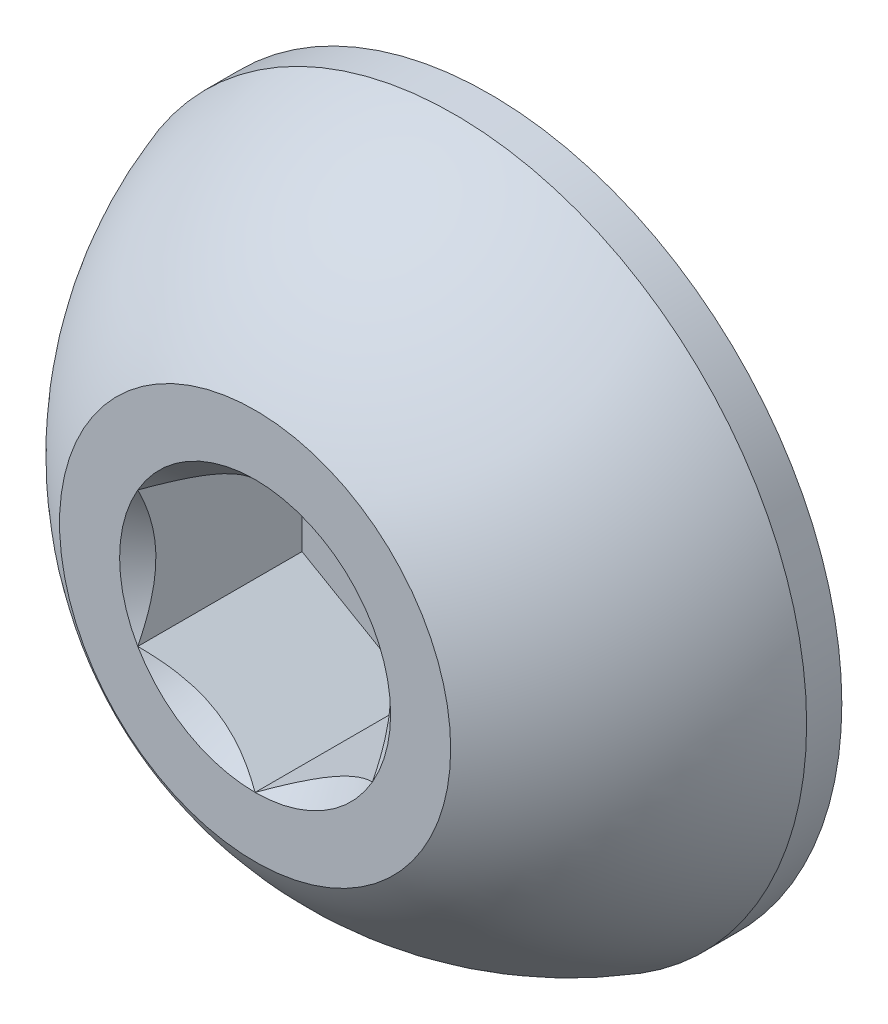
ISO-10303-21;
HEADER;
FILE_DESCRIPTION(('STEP AP214'),'2;1');
FILE_NAME('part.step','',(''),(''),'','','');
FILE_SCHEMA(('AUTOMOTIVE_DESIGN { 1 0 10303 214 1 1 1 1 }'));
ENDSEC;
DATA;
#1=APPLICATION_CONTEXT('core data for automotive mechanical design processes');
#2=APPLICATION_PROTOCOL_DEFINITION('international standard','automotive_design',2000,#1);
#3=PRODUCT_CONTEXT('',#1,'mechanical');
#4=PRODUCT('Part','Part','',(#3));
#5=PRODUCT_RELATED_PRODUCT_CATEGORY('part','',(#4));
#6=PRODUCT_DEFINITION_FORMATION('','',#4);
#7=PRODUCT_DEFINITION_CONTEXT('part definition',#1,'design');
#8=PRODUCT_DEFINITION('design','',#6,#7);
#9=PRODUCT_DEFINITION_SHAPE('','',#8);
#10=(LENGTH_UNIT() NAMED_UNIT(*) SI_UNIT(.MILLI.,.METRE.));
#11=(NAMED_UNIT(*) PLANE_ANGLE_UNIT() SI_UNIT($,.RADIAN.));
#12=(NAMED_UNIT(*) SI_UNIT($,.STERADIAN.) SOLID_ANGLE_UNIT());
#13=UNCERTAINTY_MEASURE_WITH_UNIT(LENGTH_MEASURE(1.E-05),#10,'distance_accuracy_value','');
#14=(GEOMETRIC_REPRESENTATION_CONTEXT(3) GLOBAL_UNCERTAINTY_ASSIGNED_CONTEXT((#13)) GLOBAL_UNIT_ASSIGNED_CONTEXT((#10,
#11,#12)) REPRESENTATION_CONTEXT('',''));
#15=CARTESIAN_POINT('',(0.,0.,0.));
#16=DIRECTION('',(0.,0.,1.));
#17=DIRECTION('',(1.,0.,0.));
#18=AXIS2_PLACEMENT_3D('',#15,#16,#17);
#19=CARTESIAN_POINT('',(0.,0.,-2.01004901960784));
#20=DIRECTION('',(0.,0.,1.));
#21=DIRECTION('',(0.,-1.,0.));
#22=AXIS2_PLACEMENT_3D('',#19,#20,#21);
#23=SPHERICAL_SURFACE('',#22,2.3670228265115);
#24=CARTESIAN_POINT('',(0.,0.,0.));
#25=DIRECTION('',(0.,0.,1.));
#26=DIRECTION('',(1.,0.,0.));
#27=AXIS2_PLACEMENT_3D('',#24,#25,#26);
#28=CIRCLE('',#27,1.25000000000002);
#29=CARTESIAN_POINT('',(1.25000000000002,0.,0.));
#30=VERTEX_POINT('',#29);
#31=EDGE_CURVE('E56',#30,#30,#28,.T.);
#32=ORIENTED_EDGE('',*,*,#31,.F.);
#33=EDGE_LOOP('',(#32));
#34=FACE_BOUND('',#33,.T.);
#35=CARTESIAN_POINT('',(0.,0.,-1.275));
#36=DIRECTION('',(0.,0.,1.));
#37=DIRECTION('',(1.,0.,0.));
#38=AXIS2_PLACEMENT_3D('',#35,#36,#37);
#39=CIRCLE('',#38,2.25);
#40=CARTESIAN_POINT('',(2.25,0.,-1.275));
#41=VERTEX_POINT('',#40);
#42=EDGE_CURVE('E170',#41,#41,#39,.T.);
#43=ORIENTED_EDGE('',*,*,#42,.T.);
#44=EDGE_LOOP('',(#43));
#45=FACE_BOUND('',#44,.T.);
#46=ADVANCED_FACE('F43',(#34,#45),#23,.T.);
#47=CARTESIAN_POINT('',(0.,-1.25000000000002,0.));
#48=DIRECTION('',(0.,0.,-1.));
#49=DIRECTION('',(-1.,0.,0.));
#50=AXIS2_PLACEMENT_3D('',#47,#48,#49);
#51=PLANE('',#50);
#52=CARTESIAN_POINT('',(0.,0.,0.));
#53=DIRECTION('',(0.,0.,1.));
#54=DIRECTION('',(1.,0.,0.));
#55=AXIS2_PLACEMENT_3D('',#52,#53,#54);
#56=CIRCLE('',#55,0.866025403784436);
#57=CARTESIAN_POINT('',(-0.749999999999998,0.433012701892219,0.));
#58=VERTEX_POINT('',#57);
#59=CARTESIAN_POINT('',(-0.749999999999997,-0.43301270189222,0.));
#60=VERTEX_POINT('',#59);
#61=EDGE_CURVE('E69',#58,#60,#56,.T.);
#62=ORIENTED_EDGE('',*,*,#61,.F.);
#63=CARTESIAN_POINT('',(0.,0.866025403784436,0.));
#64=VERTEX_POINT('',#63);
#65=EDGE_CURVE('E141',#64,#58,#56,.T.);
#66=ORIENTED_EDGE('',*,*,#65,.F.);
#67=CARTESIAN_POINT('',(0.749999999999999,0.433012701892216,0.));
#68=VERTEX_POINT('',#67);
#69=EDGE_CURVE('E138',#68,#64,#56,.T.);
#70=ORIENTED_EDGE('',*,*,#69,.F.);
#71=CARTESIAN_POINT('',(0.749999999999999,-0.433012701892216,0.));
#72=VERTEX_POINT('',#71);
#73=EDGE_CURVE('E109',#72,#68,#56,.T.);
#74=ORIENTED_EDGE('',*,*,#73,.F.);
#75=CARTESIAN_POINT('',(0.,-0.866025403784436,0.));
#76=VERTEX_POINT('',#75);
#77=EDGE_CURVE('E101',#76,#72,#56,.T.);
#78=ORIENTED_EDGE('',*,*,#77,.F.);
#79=EDGE_CURVE('E62',#60,#76,#56,.T.);
#80=ORIENTED_EDGE('',*,*,#79,.F.);
#81=EDGE_LOOP('',(#62,#66,#70,#74,#78,#80));
#82=FACE_BOUND('',#81,.T.);
#83=ORIENTED_EDGE('',*,*,#31,.T.);
#84=EDGE_LOOP('',(#83));
#85=FACE_BOUND('',#84,.T.);
#86=ADVANCED_FACE('F135',(#82,#85),#51,.F.);
#87=CARTESIAN_POINT('',(0.,-2.25,-1.5));
#88=DIRECTION('',(0.,0.,1.));
#89=DIRECTION('',(1.,0.,0.));
#90=AXIS2_PLACEMENT_3D('',#87,#88,#89);
#91=PLANE('',#90);
#92=CARTESIAN_POINT('',(0.,0.,-1.5));
#93=DIRECTION('',(0.,0.,1.));
#94=DIRECTION('',(1.,0.,0.));
#95=AXIS2_PLACEMENT_3D('',#92,#93,#94);
#96=CIRCLE('',#95,2.25);
#97=CARTESIAN_POINT('',(2.25,0.,-1.5));
#98=VERTEX_POINT('',#97);
#99=EDGE_CURVE('E173',#98,#98,#96,.T.);
#100=ORIENTED_EDGE('',*,*,#99,.F.);
#101=EDGE_LOOP('',(#100));
#102=FACE_BOUND('',#101,.T.);
#103=ADVANCED_FACE('F185',(#102),#91,.F.);
#104=CARTESIAN_POINT('',(0.,0.,0.));
#105=DIRECTION('',(0.,0.,1.));
#106=DIRECTION('',(1.,0.,0.));
#107=AXIS2_PLACEMENT_3D('',#104,#105,#106);
#108=CYLINDRICAL_SURFACE('',#107,2.25);
#109=ORIENTED_EDGE('',*,*,#42,.F.);
#110=EDGE_LOOP('',(#109));
#111=FACE_BOUND('',#110,.T.);
#112=ORIENTED_EDGE('',*,*,#99,.T.);
#113=EDGE_LOOP('',(#112));
#114=FACE_BOUND('',#113,.T.);
#115=ADVANCED_FACE('F182',(#111,#114),#108,.T.);
#116=CARTESIAN_POINT('',(0.,0.,0.));
#117=DIRECTION('',(0.,0.,1.));
#118=DIRECTION('',(1.,0.,0.));
#119=AXIS2_PLACEMENT_3D('',#116,#117,#118);
#120=CONICAL_SURFACE('',#119,0.866025403784436,0.78539816339745);
#121=ORIENTED_EDGE('',*,*,#73,.T.);
#122=CARTESIAN_POINT('',(0.749999999999999,-0.863604064848458,0.277789258135394));
#123=CARTESIAN_POINT('',(0.749999999999999,-0.842575879734328,0.261914932008409));
#124=CARTESIAN_POINT('',(0.749999999999999,-0.821430496291556,0.246196265183002));
#125=CARTESIAN_POINT('',(0.749999999999999,-0.778857857419015,0.215134520626627));
#126=CARTESIAN_POINT('',(0.749999999999999,-0.757430533042232,0.199791537493553));
#127=CARTESIAN_POINT('',(0.749999999999999,-0.692340710712932,0.154203580293665));
#128=CARTESIAN_POINT('',(0.749999999999999,-0.648190081053409,0.124644091743429));
#129=CARTESIAN_POINT('',(0.749999999999999,-0.555607181501746,0.0666155826927986));
#130=CARTESIAN_POINT('',(0.749999999999999,-0.507074363017993,0.0383051093657942));
#131=CARTESIAN_POINT('',(0.749999999999999,-0.407587529772334,-0.0134818882311094));
#132=CARTESIAN_POINT('',(0.749999999999999,-0.356642419548468,-0.0369747084681448));
#133=CARTESIAN_POINT('',(0.749999999999999,-0.280165468820768,-0.0657131004993218));
#134=CARTESIAN_POINT('',(0.749999999999999,-0.255770023930569,-0.0739607251869441));
#135=CARTESIAN_POINT('',(0.749999999999999,-0.206403277885129,-0.0885028245798072));
#136=CARTESIAN_POINT('',(0.749999999999999,-0.181431937185905,-0.094797164730879));
#137=CARTESIAN_POINT('',(0.749999999999999,-0.106699879404922,-0.110006826119402));
#138=CARTESIAN_POINT('',(0.749999999999999,-0.0561907171762156,-0.115622815287103));
#139=CARTESIAN_POINT('',(0.749999999999999,0.0430767231749075,-0.116371743545645));
#140=CARTESIAN_POINT('',(0.749999999999999,0.0918322434166296,-0.111876548594385));
#141=CARTESIAN_POINT('',(0.749999999999999,0.164112195698295,-0.0986626925540142));
#142=CARTESIAN_POINT('',(0.749999999999999,0.188278676879437,-0.0930985536179195));
#143=CARTESIAN_POINT('',(0.749999999999999,0.236094480120332,-0.0800768338512722));
#144=CARTESIAN_POINT('',(0.749999999999999,0.259743845273042,-0.072619411452338));
#145=CARTESIAN_POINT('',(0.749999999999999,0.33419827846382,-0.0463335305339105));
#146=CARTESIAN_POINT('',(0.749999999999999,0.383940060445496,-0.0245096619515532));
#147=CARTESIAN_POINT('',(0.749999999999999,0.481089225076667,0.0240118041005906));
#148=CARTESIAN_POINT('',(0.749999999999999,0.528487417973017,0.0507269113103548));
#149=CARTESIAN_POINT('',(0.749999999999999,0.619071540465252,0.105842851150783));
#150=CARTESIAN_POINT('',(0.749999999999999,0.66234974530024,0.134093945452189));
#151=CARTESIAN_POINT('',(0.749999999999999,0.726111623216225,0.177767147097506));
#152=CARTESIAN_POINT('',(0.749999999999999,0.747090419255281,0.192478860516705));
#153=CARTESIAN_POINT('',(0.749999999999999,0.788761341501861,0.222291384102404));
#154=CARTESIAN_POINT('',(0.749999999999999,0.80945354453562,0.237392086763034));
#155=CARTESIAN_POINT('',(0.749999999999999,0.83002639009747,0.25265408930473));
#156=B_SPLINE_CURVE_WITH_KNOTS('',3,(#122,#123,#124,#125,#126,#127,#128,#129,#130,#131,#132,
#133,#134,#135,#136,#137,#138,#139,#140,#141,#142,#143,#144,#145,#146,#147,#148,#149,#150,#151,
#152,#153,#154,#155),.UNSPECIFIED.,.F.,.F.,(4,2,2,2,2,2,2,2,2,2,2,2,2,2,2,2,4),(0.,
0.0790398443124675,0.158099390497592,0.3174252086741,0.485845155681375,0.653685658303954,
0.730869805636062,0.808059268704005,0.959469653380775,1.10540290447489,1.17973203111653,
1.25405493988071,1.41653726506053,1.57961304287542,1.73458511695815,1.81145152932466,
1.8882969211581),.UNSPECIFIED.);
#157=EDGE_CURVE('E11',#72,#68,#156,.T.);
#158=ORIENTED_EDGE('',*,*,#157,.F.);
#159=EDGE_LOOP('',(#121,#158));
#160=FACE_BOUND('',#159,.T.);
#161=ADVANCED_FACE('F113',(#160),#120,.F.);
#162=ORIENTED_EDGE('',*,*,#69,.T.);
#163=CARTESIAN_POINT('',(0.750199999999999,0.43289723183838,0.000115493144770654));
#164=CARTESIAN_POINT('',(0.724410037442318,0.447787073663448,-0.0147658895360747));
#165=CARTESIAN_POINT('',(0.69818879787134,0.462925913388238,-0.0287737343930421));
#166=CARTESIAN_POINT('',(0.644720291764293,0.493795969782308,-0.0544224753177408));
#167=CARTESIAN_POINT('',(0.617467932539426,0.509530126716837,-0.0660490882943327));
#168=CARTESIAN_POINT('',(0.562514649618646,0.541257419404003,-0.0859659542277555));
#169=CARTESIAN_POINT('',(0.53482774330449,0.55724246221751,-0.0943063059186281));
#170=CARTESIAN_POINT('',(0.478844404869146,0.589564457733289,-0.107157258038573));
#171=CARTESIAN_POINT('',(0.450549685156354,0.605900421776115,-0.111677459411163));
#172=CARTESIAN_POINT('',(0.401789710731155,0.634052006136182,-0.115754166902564));
#173=CARTESIAN_POINT('',(0.381387934344426,0.645830977225007,-0.11635720338592));
#174=CARTESIAN_POINT('',(0.340623865303639,0.66936612345897,-0.115345493984473));
#175=CARTESIAN_POINT('',(0.320261582348544,0.68112229300441,-0.113730259009965));
#176=CARTESIAN_POINT('',(0.259465456913175,0.716222952390206,-0.10566385302696));
#177=CARTESIAN_POINT('',(0.2193341450039,0.739392776123959,-0.0959910641722805));
#178=CARTESIAN_POINT('',(0.148889599645974,0.780063953349298,-0.0726436820276846));
#179=CARTESIAN_POINT('',(0.118246427990913,0.797755796753171,-0.0601914419277469));
#180=CARTESIAN_POINT('',(0.0581606541952101,0.832446334428587,-0.0321403897691397));
#181=CARTESIAN_POINT('',(0.0287145116184093,0.849447072771899,-0.0165518140962495));
#182=CARTESIAN_POINT('',(-0.000199999999999621,0.866140873838274,0.000115493144769629));
#183=B_SPLINE_CURVE_WITH_KNOTS('',3,(#163,#164,#165,#166,#167,#168,#169,#170,#171,#172,#173,
#174,#175,#176,#177,#178,#179,#180,#181,#182),.UNSPECIFIED.,.F.,.F.,(4,2,2,2,2,2,2,2,2,4),(0.,
0.0999419466095599,0.200466857654446,0.299393763705718,0.398071297300231,0.468665775681749,
0.53927582139884,0.680536257244567,0.792918418368073,0.90493956871603),.UNSPECIFIED.);
#184=EDGE_CURVE('E140',#68,#64,#183,.T.);
#185=ORIENTED_EDGE('',*,*,#184,.F.);
#186=EDGE_LOOP('',(#162,#185));
#187=FACE_BOUND('',#186,.T.);
#188=ADVANCED_FACE('F275',(#187),#120,.F.);
#189=ORIENTED_EDGE('',*,*,#65,.T.);
#190=CARTESIAN_POINT('',(0.00020000000000047,0.866140873838274,0.000115493144769656));
#191=CARTESIAN_POINT('',(-0.0255899625576809,0.851251032013207,-0.0147658895360758));
#192=CARTESIAN_POINT('',(-0.0518112021286586,0.836112192288417,-0.0287737343930431));
#193=CARTESIAN_POINT('',(-0.105279708235706,0.805242135894346,-0.0544224753177416));
#194=CARTESIAN_POINT('',(-0.132532067460572,0.789507978959817,-0.0660490882943334));
#195=CARTESIAN_POINT('',(-0.187485350381352,0.757780686272651,-0.0859659542277561));
#196=CARTESIAN_POINT('',(-0.215172256695509,0.741795643459145,-0.0943063059186287));
#197=CARTESIAN_POINT('',(-0.271155595130852,0.709473647943365,-0.107157258038574));
#198=CARTESIAN_POINT('',(-0.299450314843644,0.69313768390054,-0.111677459411163));
#199=CARTESIAN_POINT('',(-0.348210289268843,0.664986099540473,-0.115754166902564));
#200=CARTESIAN_POINT('',(-0.368612065655572,0.653207128451648,-0.116357203385921));
#201=CARTESIAN_POINT('',(-0.409376134696359,0.629671982217685,-0.115345493984473));
#202=CARTESIAN_POINT('',(-0.429738417651454,0.617915812672246,-0.113730259009966));
#203=CARTESIAN_POINT('',(-0.490534543086823,0.582815153286449,-0.10566385302696));
#204=CARTESIAN_POINT('',(-0.530665854996098,0.559645329552697,-0.0959910641722807));
#205=CARTESIAN_POINT('',(-0.601110400354024,0.518974152327357,-0.0726436820276848));
#206=CARTESIAN_POINT('',(-0.631753572009085,0.501282308923484,-0.0601914419277471));
#207=CARTESIAN_POINT('',(-0.691839345804788,0.466591771248068,-0.0321403897691397));
#208=CARTESIAN_POINT('',(-0.721285488381589,0.449591032904756,-0.0165518140962495));
#209=CARTESIAN_POINT('',(-0.750199999999998,0.432897231838381,0.000115493144769542));
#210=B_SPLINE_CURVE_WITH_KNOTS('',3,(#190,#191,#192,#193,#194,#195,#196,#197,#198,#199,#200,
#201,#202,#203,#204,#205,#206,#207,#208,#209),.UNSPECIFIED.,.F.,.F.,(4,2,2,2,2,2,2,2,2,4),(0.,
0.0999419466095595,0.200466857654446,0.299393763705717,0.39807129730023,0.468665775681747,
0.539275821398838,0.680536257244565,0.792918418368072,0.904939568716029),.UNSPECIFIED.);
#211=EDGE_CURVE('E145',#64,#58,#210,.T.);
#212=ORIENTED_EDGE('',*,*,#211,.F.);
#213=EDGE_LOOP('',(#189,#212));
#214=FACE_BOUND('',#213,.T.);
#215=ADVANCED_FACE('F148',(#214),#120,.F.);
#216=ORIENTED_EDGE('',*,*,#61,.T.);
#217=CARTESIAN_POINT('',(-0.749999999999997,-0.863604064974108,0.277789258230262));
#218=CARTESIAN_POINT('',(-0.749999999999997,-0.842575879856454,0.261914932099622));
#219=CARTESIAN_POINT('',(-0.749999999999997,-0.821430496410145,0.246196265270567));
#220=CARTESIAN_POINT('',(-0.749999999999997,-0.778857857530495,0.215134520706917));
#221=CARTESIAN_POINT('',(-0.749999999999997,-0.75743053315014,0.199791537570216));
#222=CARTESIAN_POINT('',(-0.749999999999997,-0.692340710809907,0.154203580359378));
#223=CARTESIAN_POINT('',(-0.749999999999997,-0.64819008114295,0.124644091801872));
#224=CARTESIAN_POINT('',(-0.749999999999997,-0.555607181575072,0.0666155827362887));
#225=CARTESIAN_POINT('',(-0.749999999999997,-0.507074363082495,0.0383051094016556));
#226=CARTESIAN_POINT('',(-0.749999999999997,-0.40758752981844,-0.0134818882093895));
#227=CARTESIAN_POINT('',(-0.749999999999997,-0.356642419585007,-0.0369747084529473));
#228=CARTESIAN_POINT('',(-0.749999999999997,-0.280165468850109,-0.0657131004889679));
#229=CARTESIAN_POINT('',(-0.749999999999997,-0.255770023962926,-0.0739607251764025));
#230=CARTESIAN_POINT('',(-0.749999999999997,-0.20640327792361,-0.0885028245694942));
#231=CARTESIAN_POINT('',(-0.749999999999997,-0.181431937227494,-0.0947971647209821));
#232=CARTESIAN_POINT('',(-0.749999999999997,-0.106699879455629,-0.11000682611185));
#233=CARTESIAN_POINT('',(-0.749999999999997,-0.0561907172329773,-0.115622815282492));
#234=CARTESIAN_POINT('',(-0.749999999999997,0.043076723107419,-0.116371743549174));
#235=CARTESIAN_POINT('',(-0.749999999999998,0.0918322433444372,-0.111876548602975));
#236=CARTESIAN_POINT('',(-0.749999999999998,0.164112195619625,-0.0986626925707834));
#237=CARTESIAN_POINT('',(-0.749999999999998,0.188278676798616,-0.0930985536375686));
#238=CARTESIAN_POINT('',(-0.749999999999998,0.236094480035413,-0.0800768338767462));
#239=CARTESIAN_POINT('',(-0.749999999999998,0.259743845186175,-0.0726194114807571));
#240=CARTESIAN_POINT('',(-0.749999999999998,0.334198278358036,-0.0463335305762107));
#241=CARTESIAN_POINT('',(-0.749999999999998,0.383940060323693,-0.0245096620066248));
#242=CARTESIAN_POINT('',(-0.749999999999998,0.481089224924054,0.0240118040185693));
#243=CARTESIAN_POINT('',(-0.749999999999998,0.528487417805621,0.0507269112141451));
#244=CARTESIAN_POINT('',(-0.749999999999998,0.619071540271276,0.105842851027416));
#245=CARTESIAN_POINT('',(-0.749999999999998,0.662349745094375,0.134093945315977));
#246=CARTESIAN_POINT('',(-0.749999999999998,0.72611162299278,0.177767146942095));
#247=CARTESIAN_POINT('',(-0.749999999999998,0.74709041902606,0.192478860354944));
#248=CARTESIAN_POINT('',(-0.749999999999998,0.788761341261126,0.222291383927952));
#249=CARTESIAN_POINT('',(-0.749999999999998,0.809453544289147,0.237392086582241));
#250=CARTESIAN_POINT('',(-0.749999999999998,0.830026389845268,0.252654089117603));
#251=B_SPLINE_CURVE_WITH_KNOTS('',3,(#217,#218,#219,#220,#221,#222,#223,#224,#225,#226,#227,
#228,#229,#230,#231,#232,#233,#234,#235,#236,#237,#238,#239,#240,#241,#242,#243,#244,#245,#246,
#247,#248,#249,#250),.UNSPECIFIED.,.F.,.F.,(4,2,2,2,2,2,2,2,2,2,2,2,2,2,2,2,4),(0.,
0.079039844327512,0.158099390527686,0.317425208734853,0.485845155776511,0.653685658433146,
0.730869805756537,0.808059268815779,0.95946965347593,1.10540290455479,1.1797320311882,
1.25405493994416,1.41653726506483,1.57961304282019,1.73458511685198,1.81145152919336,
1.88829692100168),.UNSPECIFIED.);
#252=EDGE_CURVE('E152',#58,#60,#251,.F.);
#253=ORIENTED_EDGE('',*,*,#252,.F.);
#254=EDGE_LOOP('',(#216,#253));
#255=FACE_BOUND('',#254,.T.);
#256=ADVANCED_FACE('F269',(#255),#120,.F.);
#257=ORIENTED_EDGE('',*,*,#79,.T.);
#258=CARTESIAN_POINT('',(-0.750199999999997,-0.43289723183838,0.000115493144768594));
#259=CARTESIAN_POINT('',(-0.724410037442316,-0.447787073663447,-0.0147658895360768));
#260=CARTESIAN_POINT('',(-0.698188797871338,-0.462925913388237,-0.0287737343930441));
#261=CARTESIAN_POINT('',(-0.644720291764291,-0.493795969782308,-0.0544224753177427));
#262=CARTESIAN_POINT('',(-0.617467932539425,-0.509530126716837,-0.0660490882943345));
#263=CARTESIAN_POINT('',(-0.562514649618644,-0.541257419404003,-0.0859659542277573));
#264=CARTESIAN_POINT('',(-0.534827743304488,-0.557242462217509,-0.0943063059186298));
#265=CARTESIAN_POINT('',(-0.478844404869144,-0.589564457733288,-0.107157258038575));
#266=CARTESIAN_POINT('',(-0.450549685156353,-0.605900421776114,-0.111677459411164));
#267=CARTESIAN_POINT('',(-0.401789710731154,-0.634052006136181,-0.115754166902565));
#268=CARTESIAN_POINT('',(-0.381387934344425,-0.645830977225006,-0.116357203385922));
#269=CARTESIAN_POINT('',(-0.340623865303638,-0.669366123458969,-0.115345493984474));
#270=CARTESIAN_POINT('',(-0.320261582348543,-0.681122293004408,-0.113730259009967));
#271=CARTESIAN_POINT('',(-0.259465456913174,-0.716222952390204,-0.105663853026962));
#272=CARTESIAN_POINT('',(-0.219334145003899,-0.739392776123957,-0.095991064172282));
#273=CARTESIAN_POINT('',(-0.148889599645973,-0.780063953349297,-0.0726436820276861));
#274=CARTESIAN_POINT('',(-0.118246427990912,-0.79775579675317,-0.0601914419277484));
#275=CARTESIAN_POINT('',(-0.0581606541952087,-0.832446334428586,-0.0321403897691409));
#276=CARTESIAN_POINT('',(-0.0287145116184077,-0.849447072771898,-0.0165518140962506));
#277=CARTESIAN_POINT('',(0.000200000000001459,-0.866140873838273,0.000115493144768732));
#278=B_SPLINE_CURVE_WITH_KNOTS('',3,(#258,#259,#260,#261,#262,#263,#264,#265,#266,#267,#268,
#269,#270,#271,#272,#273,#274,#275,#276,#277),.UNSPECIFIED.,.F.,.F.,(4,2,2,2,2,2,2,2,2,4),(0.,
0.0999419466095596,0.200466857654446,0.299393763705717,0.39807129730023,0.468665775681747,
0.539275821398838,0.680536257244565,0.792918418368072,0.90493956871603),.UNSPECIFIED.);
#279=EDGE_CURVE('E125',#60,#76,#278,.T.);
#280=ORIENTED_EDGE('',*,*,#279,.F.);
#281=EDGE_LOOP('',(#257,#280));
#282=FACE_BOUND('',#281,.T.);
#283=ADVANCED_FACE('F217',(#282),#120,.F.);
#284=ORIENTED_EDGE('',*,*,#77,.T.);
#285=CARTESIAN_POINT('',(-0.000199999999998629,-0.866140873838273,0.00011549314476868));
#286=CARTESIAN_POINT('',(0.0255899625576827,-0.851251032013206,-0.0147658895360766));
#287=CARTESIAN_POINT('',(0.0518112021286603,-0.836112192288416,-0.0287737343930438));
#288=CARTESIAN_POINT('',(0.105279708235707,-0.805242135894345,-0.0544224753177422));
#289=CARTESIAN_POINT('',(0.132532067460574,-0.789507978959816,-0.0660490882943339));
#290=CARTESIAN_POINT('',(0.187485350381354,-0.75778068627265,-0.0859659542277566));
#291=CARTESIAN_POINT('',(0.21517225669551,-0.741795643459144,-0.0943063059186291));
#292=CARTESIAN_POINT('',(0.271155595130853,-0.709473647943365,-0.107157258038574));
#293=CARTESIAN_POINT('',(0.299450314843645,-0.693137683900539,-0.111677459411163));
#294=CARTESIAN_POINT('',(0.348210289268843,-0.664986099540472,-0.115754166902565));
#295=CARTESIAN_POINT('',(0.368612065655572,-0.653207128451647,-0.116357203385921));
#296=CARTESIAN_POINT('',(0.40937613469636,-0.629671982217684,-0.115345493984474));
#297=CARTESIAN_POINT('',(0.429738417651455,-0.617915812672244,-0.113730259009966));
#298=CARTESIAN_POINT('',(0.490534543086823,-0.582815153286448,-0.105663853026961));
#299=CARTESIAN_POINT('',(0.530665854996099,-0.559645329552695,-0.095991064172281));
#300=CARTESIAN_POINT('',(0.601110400354025,-0.518974152327356,-0.0726436820276849));
#301=CARTESIAN_POINT('',(0.631753572009086,-0.501282308923482,-0.0601914419277472));
#302=CARTESIAN_POINT('',(0.691839345804789,-0.466591771248066,-0.0321403897691396));
#303=CARTESIAN_POINT('',(0.72128548838159,-0.449591032904754,-0.0165518140962492));
#304=CARTESIAN_POINT('',(0.750199999999999,-0.432897231838379,0.00011549314477007));
#305=B_SPLINE_CURVE_WITH_KNOTS('',3,(#285,#286,#287,#288,#289,#290,#291,#292,#293,#294,#295,
#296,#297,#298,#299,#300,#301,#302,#303,#304),.UNSPECIFIED.,.F.,.F.,(4,2,2,2,2,2,2,2,2,4),(0.,
0.0999419466095592,0.200466857654445,0.299393763705716,0.398071297300229,0.468665775681746,
0.539275821398837,0.680536257244564,0.792918418368072,0.90493956871603),.UNSPECIFIED.);
#306=EDGE_CURVE('E105',#76,#72,#305,.T.);
#307=ORIENTED_EDGE('',*,*,#306,.F.);
#308=EDGE_LOOP('',(#284,#307));
#309=FACE_BOUND('',#308,.T.);
#310=ADVANCED_FACE('F103',(#309),#120,.F.);
#311=CARTESIAN_POINT('',(0.749999999999999,-0.433012701892217,-1.05));
#312=DIRECTION('',(0.,0.,1.));
#313=DIRECTION('',(1.,0.,0.));
#314=AXIS2_PLACEMENT_3D('',#311,#312,#313);
#315=PLANE('',#314);
#316=DIRECTION('',(0.866025403784438,0.500000000000001,0.));
#317=VECTOR('',#316,1.);
#318=CARTESIAN_POINT('',(0.,-0.866025403784435,-1.05));
#319=LINE('',#318,#317);
#320=CARTESIAN_POINT('',(0.,-0.866025403784435,-1.05));
#321=VERTEX_POINT('',#320);
#322=CARTESIAN_POINT('',(0.749999999999999,-0.433012701892217,-1.05));
#323=VERTEX_POINT('',#322);
#324=EDGE_CURVE('E124',#321,#323,#319,.T.);
#325=ORIENTED_EDGE('',*,*,#324,.T.);
#326=DIRECTION('',(0.,1.,0.));
#327=VECTOR('',#326,1.);
#328=CARTESIAN_POINT('',(0.749999999999999,-0.433012701892217,-1.05));
#329=LINE('',#328,#327);
#330=CARTESIAN_POINT('',(0.749999999999999,0.433012701892218,-1.05));
#331=VERTEX_POINT('',#330);
#332=EDGE_CURVE('E129',#323,#331,#329,.T.);
#333=ORIENTED_EDGE('',*,*,#332,.T.);
#334=DIRECTION('',(-0.866025403784439,0.5,0.));
#335=VECTOR('',#334,1.);
#336=CARTESIAN_POINT('',(0.749999999999999,0.433012701892218,-1.05));
#337=LINE('',#336,#335);
#338=CARTESIAN_POINT('',(0.,0.866025403784436,-1.05));
#339=VERTEX_POINT('',#338);
#340=EDGE_CURVE('E259',#331,#339,#337,.T.);
#341=ORIENTED_EDGE('',*,*,#340,.T.);
#342=DIRECTION('',(-0.866025403784439,-0.499999999999999,0.));
#343=VECTOR('',#342,1.);
#344=CARTESIAN_POINT('',(0.,0.866025403784436,-1.05));
#345=LINE('',#344,#343);
#346=CARTESIAN_POINT('',(-0.749999999999998,0.433012701892219,-1.05));
#347=VERTEX_POINT('',#346);
#348=EDGE_CURVE('E161',#339,#347,#345,.T.);
#349=ORIENTED_EDGE('',*,*,#348,.T.);
#350=DIRECTION('',(0.,-1.,0.));
#351=VECTOR('',#350,1.);
#352=CARTESIAN_POINT('',(-0.749999999999998,0.433012701892219,-1.05));
#353=LINE('',#352,#351);
#354=CARTESIAN_POINT('',(-0.749999999999997,-0.433012701892218,-1.05));
#355=VERTEX_POINT('',#354);
#356=EDGE_CURVE('E263',#347,#355,#353,.T.);
#357=ORIENTED_EDGE('',*,*,#356,.T.);
#358=DIRECTION('',(0.866025403784439,-0.5,0.));
#359=VECTOR('',#358,1.);
#360=CARTESIAN_POINT('',(-0.749999999999997,-0.433012701892218,-1.05));
#361=LINE('',#360,#359);
#362=EDGE_CURVE('E132',#355,#321,#361,.T.);
#363=ORIENTED_EDGE('',*,*,#362,.T.);
#364=EDGE_LOOP('',(#325,#333,#341,#349,#357,#363));
#365=FACE_BOUND('',#364,.T.);
#366=ADVANCED_FACE('F216',(#365),#315,.T.);
#367=CARTESIAN_POINT('',(0.749999999999999,-0.433012701892217,-1.05));
#368=DIRECTION('',(1.,0.,0.));
#369=DIRECTION('',(0.,0.,-1.));
#370=AXIS2_PLACEMENT_3D('',#367,#368,#369);
#371=PLANE('',#370);
#372=DIRECTION('',(0.,0.,1.));
#373=VECTOR('',#372,1.);
#374=CARTESIAN_POINT('',(0.749999999999999,-0.433012701892217,-1.05));
#375=LINE('',#374,#373);
#376=EDGE_CURVE('E121',#323,#72,#375,.T.);
#377=ORIENTED_EDGE('',*,*,#376,.T.);
#378=ORIENTED_EDGE('',*,*,#157,.T.);
#379=DIRECTION('',(0.,0.,1.));
#380=VECTOR('',#379,1.);
#381=CARTESIAN_POINT('',(0.749999999999999,0.433012701892218,-1.05));
#382=LINE('',#381,#380);
#383=EDGE_CURVE('E131',#331,#68,#382,.T.);
#384=ORIENTED_EDGE('',*,*,#383,.F.);
#385=ORIENTED_EDGE('',*,*,#332,.F.);
#386=EDGE_LOOP('',(#377,#378,#384,#385));
#387=FACE_BOUND('',#386,.T.);
#388=ADVANCED_FACE('F127',(#387),#371,.F.);
#389=CARTESIAN_POINT('',(0.749999999999999,0.433012701892218,-1.05));
#390=DIRECTION('',(0.5,0.866025403784439,0.));
#391=DIRECTION('',(-0.866025403784439,0.5,0.));
#392=AXIS2_PLACEMENT_3D('',#389,#390,#391);
#393=PLANE('',#392);
#394=ORIENTED_EDGE('',*,*,#383,.T.);
#395=ORIENTED_EDGE('',*,*,#184,.T.);
#396=DIRECTION('',(0.,0.,1.));
#397=VECTOR('',#396,1.);
#398=CARTESIAN_POINT('',(0.,0.866025403784436,-1.05));
#399=LINE('',#398,#397);
#400=EDGE_CURVE('E157',#339,#64,#399,.T.);
#401=ORIENTED_EDGE('',*,*,#400,.F.);
#402=ORIENTED_EDGE('',*,*,#340,.F.);
#403=EDGE_LOOP('',(#394,#395,#401,#402));
#404=FACE_BOUND('',#403,.T.);
#405=ADVANCED_FACE('F155',(#404),#393,.F.);
#406=CARTESIAN_POINT('',(0.,0.866025403784436,-1.05));
#407=DIRECTION('',(-0.499999999999999,0.866025403784439,0.));
#408=DIRECTION('',(-0.866025403784439,-0.499999999999999,0.));
#409=AXIS2_PLACEMENT_3D('',#406,#407,#408);
#410=PLANE('',#409);
#411=ORIENTED_EDGE('',*,*,#400,.T.);
#412=ORIENTED_EDGE('',*,*,#211,.T.);
#413=DIRECTION('',(0.,0.,1.));
#414=VECTOR('',#413,1.);
#415=CARTESIAN_POINT('',(-0.749999999999998,0.433012701892219,-1.05));
#416=LINE('',#415,#414);
#417=EDGE_CURVE('E163',#347,#58,#416,.T.);
#418=ORIENTED_EDGE('',*,*,#417,.F.);
#419=ORIENTED_EDGE('',*,*,#348,.F.);
#420=EDGE_LOOP('',(#411,#412,#418,#419));
#421=FACE_BOUND('',#420,.T.);
#422=ADVANCED_FACE('F159',(#421),#410,.F.);
#423=CARTESIAN_POINT('',(-0.749999999999998,0.433012701892219,-1.05));
#424=DIRECTION('',(-1.,0.,0.));
#425=DIRECTION('',(0.,-1.,0.));
#426=AXIS2_PLACEMENT_3D('',#423,#424,#425);
#427=PLANE('',#426);
#428=ORIENTED_EDGE('',*,*,#417,.T.);
#429=ORIENTED_EDGE('',*,*,#252,.T.);
#430=DIRECTION('',(0.,0.,1.));
#431=VECTOR('',#430,1.);
#432=CARTESIAN_POINT('',(-0.749999999999997,-0.433012701892218,-1.05));
#433=LINE('',#432,#431);
#434=EDGE_CURVE('E165',#355,#60,#433,.T.);
#435=ORIENTED_EDGE('',*,*,#434,.F.);
#436=ORIENTED_EDGE('',*,*,#356,.F.);
#437=EDGE_LOOP('',(#428,#429,#435,#436));
#438=FACE_BOUND('',#437,.T.);
#439=ADVANCED_FACE('F238',(#438),#427,.F.);
#440=CARTESIAN_POINT('',(-0.749999999999997,-0.433012701892218,-1.05));
#441=DIRECTION('',(-0.5,-0.866025403784439,0.));
#442=DIRECTION('',(0.866025403784439,-0.5,0.));
#443=AXIS2_PLACEMENT_3D('',#440,#441,#442);
#444=PLANE('',#443);
#445=ORIENTED_EDGE('',*,*,#434,.T.);
#446=ORIENTED_EDGE('',*,*,#279,.T.);
#447=DIRECTION('',(0.,0.,1.));
#448=VECTOR('',#447,1.);
#449=CARTESIAN_POINT('',(0.,-0.866025403784435,-1.05));
#450=LINE('',#449,#448);
#451=EDGE_CURVE('E123',#321,#76,#450,.T.);
#452=ORIENTED_EDGE('',*,*,#451,.F.);
#453=ORIENTED_EDGE('',*,*,#362,.F.);
#454=EDGE_LOOP('',(#445,#446,#452,#453));
#455=FACE_BOUND('',#454,.T.);
#456=ADVANCED_FACE('F197',(#455),#444,.F.);
#457=CARTESIAN_POINT('',(0.,-0.866025403784435,-1.05));
#458=DIRECTION('',(0.500000000000001,-0.866025403784438,0.));
#459=DIRECTION('',(0.866025403784438,0.500000000000001,0.));
#460=AXIS2_PLACEMENT_3D('',#457,#458,#459);
#461=PLANE('',#460);
#462=ORIENTED_EDGE('',*,*,#451,.T.);
#463=ORIENTED_EDGE('',*,*,#306,.T.);
#464=ORIENTED_EDGE('',*,*,#376,.F.);
#465=ORIENTED_EDGE('',*,*,#324,.F.);
#466=EDGE_LOOP('',(#462,#463,#464,#465));
#467=FACE_BOUND('',#466,.T.);
#468=ADVANCED_FACE('F119',(#467),#461,.F.);
#469=CLOSED_SHELL('',(#46,#86,#103,#115,#161,#188,#215,#256,#283,#310,#366,#388,#405,#422,#439,
#456,#468));
#470=MANIFOLD_SOLID_BREP('B2',#469);
#471=ADVANCED_BREP_SHAPE_REPRESENTATION('',(#18,#470),#14);
#472=SHAPE_DEFINITION_REPRESENTATION(#9,#471);
ENDSEC;
END-ISO-10303-21;
